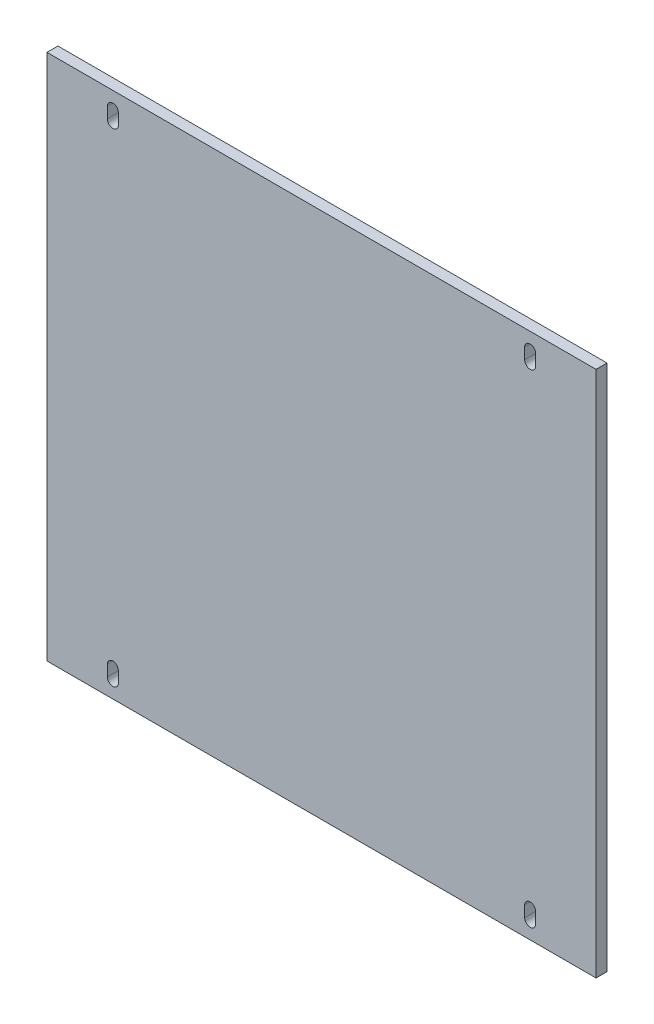
ISO-10303-21;
HEADER;
FILE_DESCRIPTION(('STEP AP214'),'2;1');
FILE_NAME('part.step','',(''),(''),'','','');
FILE_SCHEMA(('AUTOMOTIVE_DESIGN { 1 0 10303 214 1 1 1 1 }'));
ENDSEC;
DATA;
#1=APPLICATION_CONTEXT('core data for automotive mechanical design processes');
#2=APPLICATION_PROTOCOL_DEFINITION('international standard','automotive_design',2000,#1);
#3=PRODUCT_CONTEXT('',#1,'mechanical');
#4=PRODUCT('Part','Part','',(#3));
#5=PRODUCT_RELATED_PRODUCT_CATEGORY('part','',(#4));
#6=PRODUCT_DEFINITION_FORMATION('','',#4);
#7=PRODUCT_DEFINITION_CONTEXT('part definition',#1,'design');
#8=PRODUCT_DEFINITION('design','',#6,#7);
#9=PRODUCT_DEFINITION_SHAPE('','',#8);
#10=(LENGTH_UNIT() NAMED_UNIT(*) SI_UNIT(.MILLI.,.METRE.));
#11=(NAMED_UNIT(*) PLANE_ANGLE_UNIT() SI_UNIT($,.RADIAN.));
#12=(NAMED_UNIT(*) SI_UNIT($,.STERADIAN.) SOLID_ANGLE_UNIT());
#13=UNCERTAINTY_MEASURE_WITH_UNIT(LENGTH_MEASURE(1.E-05),#10,'distance_accuracy_value','');
#14=(GEOMETRIC_REPRESENTATION_CONTEXT(3) GLOBAL_UNCERTAINTY_ASSIGNED_CONTEXT((#13)) GLOBAL_UNIT_ASSIGNED_CONTEXT((#10,
#11,#12)) REPRESENTATION_CONTEXT('',''));
#15=CARTESIAN_POINT('',(0.,0.,0.));
#16=DIRECTION('',(0.,0.,1.));
#17=DIRECTION('',(1.,0.,0.));
#18=AXIS2_PLACEMENT_3D('',#15,#16,#17);
#19=CARTESIAN_POINT('',(217.5,227.5,5.));
#20=DIRECTION('',(1.,0.,0.));
#21=DIRECTION('',(0.,0.,-1.));
#22=AXIS2_PLACEMENT_3D('',#19,#20,#21);
#23=PLANE('',#22);
#24=DIRECTION('',(0.,-1.,0.));
#25=VECTOR('',#24,1.);
#26=CARTESIAN_POINT('',(217.5,227.5,0.));
#27=LINE('',#26,#25);
#28=CARTESIAN_POINT('',(217.5,232.5,0.));
#29=VERTEX_POINT('',#28);
#30=CARTESIAN_POINT('',(217.5,227.5,0.));
#31=VERTEX_POINT('',#30);
#32=EDGE_CURVE('E368',#29,#31,#27,.T.);
#33=ORIENTED_EDGE('',*,*,#32,.F.);
#34=DIRECTION('',(0.,0.,-1.));
#35=VECTOR('',#34,1.);
#36=CARTESIAN_POINT('',(217.5,232.5,5.));
#37=LINE('',#36,#35);
#38=CARTESIAN_POINT('',(217.5,232.5,5.));
#39=VERTEX_POINT('',#38);
#40=EDGE_CURVE('E11',#39,#29,#37,.T.);
#41=ORIENTED_EDGE('',*,*,#40,.F.);
#42=DIRECTION('',(0.,-1.,0.));
#43=VECTOR('',#42,1.);
#44=CARTESIAN_POINT('',(217.5,227.5,5.));
#45=LINE('',#44,#43);
#46=CARTESIAN_POINT('',(217.5,227.5,5.));
#47=VERTEX_POINT('',#46);
#48=EDGE_CURVE('E374',#39,#47,#45,.T.);
#49=ORIENTED_EDGE('',*,*,#48,.T.);
#50=DIRECTION('',(0.,0.,-1.));
#51=VECTOR('',#50,1.);
#52=CARTESIAN_POINT('',(217.5,227.5,5.));
#53=LINE('',#52,#51);
#54=EDGE_CURVE('E383',#47,#31,#53,.T.);
#55=ORIENTED_EDGE('',*,*,#54,.T.);
#56=EDGE_LOOP('',(#33,#41,#49,#55));
#57=FACE_BOUND('',#56,.T.);
#58=ADVANCED_FACE('F39',(#57),#23,.T.);
#59=CARTESIAN_POINT('',(220.,232.5,5.));
#60=DIRECTION('',(0.,0.,-1.));
#61=DIRECTION('',(-1.,0.,0.));
#62=AXIS2_PLACEMENT_3D('',#59,#60,#61);
#63=CYLINDRICAL_SURFACE('',#62,2.5);
#64=CARTESIAN_POINT('',(220.,232.5,0.));
#65=DIRECTION('',(0.,0.,1.));
#66=DIRECTION('',(1.,0.,0.));
#67=AXIS2_PLACEMENT_3D('',#64,#65,#66);
#68=CIRCLE('',#67,2.5);
#69=CARTESIAN_POINT('',(222.5,232.5,0.));
#70=VERTEX_POINT('',#69);
#71=EDGE_CURVE('E365',#70,#29,#68,.T.);
#72=ORIENTED_EDGE('',*,*,#71,.F.);
#73=DIRECTION('',(0.,0.,-1.));
#74=VECTOR('',#73,1.);
#75=CARTESIAN_POINT('',(222.5,232.5,5.));
#76=LINE('',#75,#74);
#77=CARTESIAN_POINT('',(222.5,232.5,5.));
#78=VERTEX_POINT('',#77);
#79=EDGE_CURVE('E47',#78,#70,#76,.T.);
#80=ORIENTED_EDGE('',*,*,#79,.F.);
#81=CARTESIAN_POINT('',(220.,232.5,5.));
#82=DIRECTION('',(0.,0.,1.));
#83=DIRECTION('',(1.,0.,0.));
#84=AXIS2_PLACEMENT_3D('',#81,#82,#83);
#85=CIRCLE('',#84,2.5);
#86=EDGE_CURVE('E61',#78,#39,#85,.T.);
#87=ORIENTED_EDGE('',*,*,#86,.T.);
#88=ORIENTED_EDGE('',*,*,#40,.T.);
#89=EDGE_LOOP('',(#72,#80,#87,#88));
#90=FACE_BOUND('',#89,.T.);
#91=ADVANCED_FACE('F398',(#90),#63,.F.);
#92=CARTESIAN_POINT('',(222.5,227.5,5.));
#93=DIRECTION('',(-1.,0.,0.));
#94=DIRECTION('',(0.,0.,1.));
#95=AXIS2_PLACEMENT_3D('',#92,#93,#94);
#96=PLANE('',#95);
#97=DIRECTION('',(0.,1.,0.));
#98=VECTOR('',#97,1.);
#99=CARTESIAN_POINT('',(222.5,227.5,0.));
#100=LINE('',#99,#98);
#101=CARTESIAN_POINT('',(222.5,227.5,0.));
#102=VERTEX_POINT('',#101);
#103=EDGE_CURVE('E362',#102,#70,#100,.T.);
#104=ORIENTED_EDGE('',*,*,#103,.F.);
#105=DIRECTION('',(0.,0.,-1.));
#106=VECTOR('',#105,1.);
#107=CARTESIAN_POINT('',(222.5,227.5,5.));
#108=LINE('',#107,#106);
#109=CARTESIAN_POINT('',(222.5,227.5,5.));
#110=VERTEX_POINT('',#109);
#111=EDGE_CURVE('E387',#110,#102,#108,.T.);
#112=ORIENTED_EDGE('',*,*,#111,.F.);
#113=DIRECTION('',(0.,1.,0.));
#114=VECTOR('',#113,1.);
#115=CARTESIAN_POINT('',(222.5,227.5,5.));
#116=LINE('',#115,#114);
#117=EDGE_CURVE('E380',#110,#78,#116,.T.);
#118=ORIENTED_EDGE('',*,*,#117,.T.);
#119=ORIENTED_EDGE('',*,*,#79,.T.);
#120=EDGE_LOOP('',(#104,#112,#118,#119));
#121=FACE_BOUND('',#120,.T.);
#122=ADVANCED_FACE('F394',(#121),#96,.T.);
#123=CARTESIAN_POINT('',(220.,227.5,5.));
#124=DIRECTION('',(0.,0.,-1.));
#125=DIRECTION('',(-1.,0.,0.));
#126=AXIS2_PLACEMENT_3D('',#123,#124,#125);
#127=CYLINDRICAL_SURFACE('',#126,2.5);
#128=CARTESIAN_POINT('',(220.,227.5,0.));
#129=DIRECTION('',(0.,0.,1.));
#130=DIRECTION('',(1.,0.,0.));
#131=AXIS2_PLACEMENT_3D('',#128,#129,#130);
#132=CIRCLE('',#131,2.5);
#133=EDGE_CURVE('E359',#31,#102,#132,.T.);
#134=ORIENTED_EDGE('',*,*,#133,.F.);
#135=ORIENTED_EDGE('',*,*,#54,.F.);
#136=CARTESIAN_POINT('',(220.,227.5,5.));
#137=DIRECTION('',(0.,0.,1.));
#138=DIRECTION('',(1.,0.,0.));
#139=AXIS2_PLACEMENT_3D('',#136,#137,#138);
#140=CIRCLE('',#139,2.5);
#141=EDGE_CURVE('E54',#47,#110,#140,.T.);
#142=ORIENTED_EDGE('',*,*,#141,.T.);
#143=ORIENTED_EDGE('',*,*,#111,.T.);
#144=EDGE_LOOP('',(#134,#135,#142,#143));
#145=FACE_BOUND('',#144,.T.);
#146=ADVANCED_FACE('F403',(#145),#127,.F.);
#147=CARTESIAN_POINT('',(217.5,7.50000000000001,5.));
#148=DIRECTION('',(1.,0.,0.));
#149=DIRECTION('',(0.,0.,-1.));
#150=AXIS2_PLACEMENT_3D('',#147,#148,#149);
#151=PLANE('',#150);
#152=DIRECTION('',(0.,-1.,0.));
#153=VECTOR('',#152,1.);
#154=CARTESIAN_POINT('',(217.5,7.50000000000001,0.));
#155=LINE('',#154,#153);
#156=CARTESIAN_POINT('',(217.5,12.5,0.));
#157=VERTEX_POINT('',#156);
#158=CARTESIAN_POINT('',(217.5,7.50000000000001,0.));
#159=VERTEX_POINT('',#158);
#160=EDGE_CURVE('E324',#157,#159,#155,.T.);
#161=ORIENTED_EDGE('',*,*,#160,.F.);
#162=DIRECTION('',(0.,0.,-1.));
#163=VECTOR('',#162,1.);
#164=CARTESIAN_POINT('',(217.5,12.5,5.));
#165=LINE('',#164,#163);
#166=CARTESIAN_POINT('',(217.5,12.5,5.));
#167=VERTEX_POINT('',#166);
#168=EDGE_CURVE('E355',#167,#157,#165,.T.);
#169=ORIENTED_EDGE('',*,*,#168,.F.);
#170=DIRECTION('',(0.,-1.,0.));
#171=VECTOR('',#170,1.);
#172=CARTESIAN_POINT('',(217.5,7.50000000000001,5.));
#173=LINE('',#172,#171);
#174=CARTESIAN_POINT('',(217.5,7.50000000000001,5.));
#175=VERTEX_POINT('',#174);
#176=EDGE_CURVE('E331',#167,#175,#173,.T.);
#177=ORIENTED_EDGE('',*,*,#176,.T.);
#178=DIRECTION('',(0.,0.,-1.));
#179=VECTOR('',#178,1.);
#180=CARTESIAN_POINT('',(217.5,7.50000000000001,5.));
#181=LINE('',#180,#179);
#182=EDGE_CURVE('E343',#175,#159,#181,.T.);
#183=ORIENTED_EDGE('',*,*,#182,.T.);
#184=EDGE_LOOP('',(#161,#169,#177,#183));
#185=FACE_BOUND('',#184,.T.);
#186=ADVANCED_FACE('F405',(#185),#151,.T.);
#187=CARTESIAN_POINT('',(220.,12.5,5.));
#188=DIRECTION('',(0.,0.,-1.));
#189=DIRECTION('',(-1.,0.,0.));
#190=AXIS2_PLACEMENT_3D('',#187,#188,#189);
#191=CYLINDRICAL_SURFACE('',#190,2.5);
#192=CARTESIAN_POINT('',(220.,12.5,0.));
#193=DIRECTION('',(0.,0.,1.));
#194=DIRECTION('',(1.,0.,0.));
#195=AXIS2_PLACEMENT_3D('',#192,#193,#194);
#196=CIRCLE('',#195,2.5);
#197=CARTESIAN_POINT('',(222.5,12.5,0.));
#198=VERTEX_POINT('',#197);
#199=EDGE_CURVE('E321',#198,#157,#196,.T.);
#200=ORIENTED_EDGE('',*,*,#199,.F.);
#201=DIRECTION('',(0.,0.,-1.));
#202=VECTOR('',#201,1.);
#203=CARTESIAN_POINT('',(222.5,12.5,5.));
#204=LINE('',#203,#202);
#205=CARTESIAN_POINT('',(222.5,12.5,5.));
#206=VERTEX_POINT('',#205);
#207=EDGE_CURVE('E351',#206,#198,#204,.T.);
#208=ORIENTED_EDGE('',*,*,#207,.F.);
#209=CARTESIAN_POINT('',(220.,12.5,5.));
#210=DIRECTION('',(0.,0.,1.));
#211=DIRECTION('',(1.,0.,0.));
#212=AXIS2_PLACEMENT_3D('',#209,#210,#211);
#213=CIRCLE('',#212,2.5);
#214=EDGE_CURVE('E335',#206,#167,#213,.T.);
#215=ORIENTED_EDGE('',*,*,#214,.T.);
#216=ORIENTED_EDGE('',*,*,#168,.T.);
#217=EDGE_LOOP('',(#200,#208,#215,#216));
#218=FACE_BOUND('',#217,.T.);
#219=ADVANCED_FACE('F411',(#218),#191,.F.);
#220=CARTESIAN_POINT('',(222.5,7.50000000000001,5.));
#221=DIRECTION('',(-1.,0.,0.));
#222=DIRECTION('',(0.,0.,1.));
#223=AXIS2_PLACEMENT_3D('',#220,#221,#222);
#224=PLANE('',#223);
#225=DIRECTION('',(0.,1.,0.));
#226=VECTOR('',#225,1.);
#227=CARTESIAN_POINT('',(222.5,7.50000000000001,0.));
#228=LINE('',#227,#226);
#229=CARTESIAN_POINT('',(222.5,7.50000000000001,0.));
#230=VERTEX_POINT('',#229);
#231=EDGE_CURVE('E318',#230,#198,#228,.T.);
#232=ORIENTED_EDGE('',*,*,#231,.F.);
#233=DIRECTION('',(0.,0.,-1.));
#234=VECTOR('',#233,1.);
#235=CARTESIAN_POINT('',(222.5,7.50000000000001,5.));
#236=LINE('',#235,#234);
#237=CARTESIAN_POINT('',(222.5,7.50000000000001,5.));
#238=VERTEX_POINT('',#237);
#239=EDGE_CURVE('E347',#238,#230,#236,.T.);
#240=ORIENTED_EDGE('',*,*,#239,.F.);
#241=DIRECTION('',(0.,1.,0.));
#242=VECTOR('',#241,1.);
#243=CARTESIAN_POINT('',(222.5,7.50000000000001,5.));
#244=LINE('',#243,#242);
#245=EDGE_CURVE('E339',#238,#206,#244,.T.);
#246=ORIENTED_EDGE('',*,*,#245,.T.);
#247=ORIENTED_EDGE('',*,*,#207,.T.);
#248=EDGE_LOOP('',(#232,#240,#246,#247));
#249=FACE_BOUND('',#248,.T.);
#250=ADVANCED_FACE('F444',(#249),#224,.T.);
#251=CARTESIAN_POINT('',(220.,7.50000000000001,5.));
#252=DIRECTION('',(0.,0.,-1.));
#253=DIRECTION('',(-1.,0.,0.));
#254=AXIS2_PLACEMENT_3D('',#251,#252,#253);
#255=CYLINDRICAL_SURFACE('',#254,2.5);
#256=CARTESIAN_POINT('',(220.,7.50000000000001,0.));
#257=DIRECTION('',(0.,0.,1.));
#258=DIRECTION('',(1.,0.,0.));
#259=AXIS2_PLACEMENT_3D('',#256,#257,#258);
#260=CIRCLE('',#259,2.5);
#261=EDGE_CURVE('E315',#159,#230,#260,.T.);
#262=ORIENTED_EDGE('',*,*,#261,.F.);
#263=ORIENTED_EDGE('',*,*,#182,.F.);
#264=CARTESIAN_POINT('',(220.,7.50000000000001,5.));
#265=DIRECTION('',(0.,0.,1.));
#266=DIRECTION('',(1.,0.,0.));
#267=AXIS2_PLACEMENT_3D('',#264,#265,#266);
#268=CIRCLE('',#267,2.5);
#269=EDGE_CURVE('E328',#175,#238,#268,.T.);
#270=ORIENTED_EDGE('',*,*,#269,.T.);
#271=ORIENTED_EDGE('',*,*,#239,.T.);
#272=EDGE_LOOP('',(#262,#263,#270,#271));
#273=FACE_BOUND('',#272,.T.);
#274=ADVANCED_FACE('F454',(#273),#255,.F.);
#275=CARTESIAN_POINT('',(0.,0.,5.));
#276=DIRECTION('',(0.,0.,-1.));
#277=DIRECTION('',(-1.,0.,0.));
#278=AXIS2_PLACEMENT_3D('',#275,#276,#277);
#279=PLANE('',#278);
#280=CARTESIAN_POINT('',(30.,7.5,5.));
#281=DIRECTION('',(0.,0.,1.));
#282=DIRECTION('',(1.,0.,0.));
#283=AXIS2_PLACEMENT_3D('',#280,#281,#282);
#284=CIRCLE('',#283,2.5);
#285=CARTESIAN_POINT('',(27.5,7.5,5.));
#286=VERTEX_POINT('',#285);
#287=CARTESIAN_POINT('',(32.5,7.5,5.));
#288=VERTEX_POINT('',#287);
#289=EDGE_CURVE('E231',#286,#288,#284,.T.);
#290=ORIENTED_EDGE('',*,*,#289,.F.);
#291=DIRECTION('',(0.,-1.,0.));
#292=VECTOR('',#291,1.);
#293=CARTESIAN_POINT('',(27.5,7.5,5.));
#294=LINE('',#293,#292);
#295=CARTESIAN_POINT('',(27.5,12.5,5.));
#296=VERTEX_POINT('',#295);
#297=EDGE_CURVE('E242',#296,#286,#294,.T.);
#298=ORIENTED_EDGE('',*,*,#297,.F.);
#299=CARTESIAN_POINT('',(30.,12.5,5.));
#300=DIRECTION('',(0.,0.,1.));
#301=DIRECTION('',(1.,0.,0.));
#302=AXIS2_PLACEMENT_3D('',#299,#300,#301);
#303=CIRCLE('',#302,2.5);
#304=CARTESIAN_POINT('',(32.5,12.5,5.));
#305=VERTEX_POINT('',#304);
#306=EDGE_CURVE('E238',#305,#296,#303,.T.);
#307=ORIENTED_EDGE('',*,*,#306,.F.);
#308=DIRECTION('',(0.,1.,0.));
#309=VECTOR('',#308,1.);
#310=CARTESIAN_POINT('',(32.5,7.5,5.));
#311=LINE('',#310,#309);
#312=EDGE_CURVE('E234',#288,#305,#311,.T.);
#313=ORIENTED_EDGE('',*,*,#312,.F.);
#314=EDGE_LOOP('',(#290,#298,#307,#313));
#315=FACE_BOUND('',#314,.T.);
#316=DIRECTION('',(0.,-1.,0.));
#317=VECTOR('',#316,1.);
#318=CARTESIAN_POINT('',(0.,0.,5.));
#319=LINE('',#318,#317);
#320=CARTESIAN_POINT('',(0.,240.,5.));
#321=VERTEX_POINT('',#320);
#322=CARTESIAN_POINT('',(0.,0.,5.));
#323=VERTEX_POINT('',#322);
#324=EDGE_CURVE('E274',#321,#323,#319,.T.);
#325=ORIENTED_EDGE('',*,*,#324,.T.);
#326=DIRECTION('',(1.,0.,0.));
#327=VECTOR('',#326,1.);
#328=CARTESIAN_POINT('',(0.,0.,5.));
#329=LINE('',#328,#327);
#330=CARTESIAN_POINT('',(250.,0.,5.));
#331=VERTEX_POINT('',#330);
#332=EDGE_CURVE('E278',#323,#331,#329,.T.);
#333=ORIENTED_EDGE('',*,*,#332,.T.);
#334=DIRECTION('',(0.,1.,0.));
#335=VECTOR('',#334,1.);
#336=CARTESIAN_POINT('',(250.,0.,5.));
#337=LINE('',#336,#335);
#338=CARTESIAN_POINT('',(250.,240.,5.));
#339=VERTEX_POINT('',#338);
#340=EDGE_CURVE('E282',#331,#339,#337,.T.);
#341=ORIENTED_EDGE('',*,*,#340,.T.);
#342=DIRECTION('',(-1.,0.,0.));
#343=VECTOR('',#342,1.);
#344=CARTESIAN_POINT('',(0.,240.,5.));
#345=LINE('',#344,#343);
#346=EDGE_CURVE('E285',#339,#321,#345,.T.);
#347=ORIENTED_EDGE('',*,*,#346,.T.);
#348=EDGE_LOOP('',(#325,#333,#341,#347));
#349=FACE_BOUND('',#348,.T.);
#350=CARTESIAN_POINT('',(30.,227.5,5.));
#351=DIRECTION('',(0.,0.,1.));
#352=DIRECTION('',(1.,0.,0.));
#353=AXIS2_PLACEMENT_3D('',#350,#351,#352);
#354=CIRCLE('',#353,2.5);
#355=CARTESIAN_POINT('',(27.5,227.5,5.));
#356=VERTEX_POINT('',#355);
#357=CARTESIAN_POINT('',(32.5,227.5,5.));
#358=VERTEX_POINT('',#357);
#359=EDGE_CURVE('E226',#356,#358,#354,.T.);
#360=ORIENTED_EDGE('',*,*,#359,.F.);
#361=DIRECTION('',(0.,-1.,0.));
#362=VECTOR('',#361,1.);
#363=CARTESIAN_POINT('',(27.5,227.5,5.));
#364=LINE('',#363,#362);
#365=CARTESIAN_POINT('',(27.5,232.5,5.));
#366=VERTEX_POINT('',#365);
#367=EDGE_CURVE('E189',#366,#356,#364,.T.);
#368=ORIENTED_EDGE('',*,*,#367,.F.);
#369=CARTESIAN_POINT('',(30.,232.5,5.));
#370=DIRECTION('',(0.,0.,1.));
#371=DIRECTION('',(1.,0.,0.));
#372=AXIS2_PLACEMENT_3D('',#369,#370,#371);
#373=CIRCLE('',#372,2.5);
#374=CARTESIAN_POINT('',(32.5,232.5,5.));
#375=VERTEX_POINT('',#374);
#376=EDGE_CURVE('E196',#375,#366,#373,.T.);
#377=ORIENTED_EDGE('',*,*,#376,.F.);
#378=DIRECTION('',(0.,1.,0.));
#379=VECTOR('',#378,1.);
#380=CARTESIAN_POINT('',(32.5,227.5,5.));
#381=LINE('',#380,#379);
#382=EDGE_CURVE('E219',#358,#375,#381,.T.);
#383=ORIENTED_EDGE('',*,*,#382,.F.);
#384=EDGE_LOOP('',(#360,#368,#377,#383));
#385=FACE_BOUND('',#384,.T.);
#386=ORIENTED_EDGE('',*,*,#269,.F.);
#387=ORIENTED_EDGE('',*,*,#176,.F.);
#388=ORIENTED_EDGE('',*,*,#214,.F.);
#389=ORIENTED_EDGE('',*,*,#245,.F.);
#390=EDGE_LOOP('',(#386,#387,#388,#389));
#391=FACE_BOUND('',#390,.T.);
#392=ORIENTED_EDGE('',*,*,#141,.F.);
#393=ORIENTED_EDGE('',*,*,#48,.F.);
#394=ORIENTED_EDGE('',*,*,#86,.F.);
#395=ORIENTED_EDGE('',*,*,#117,.F.);
#396=EDGE_LOOP('',(#392,#393,#394,#395));
#397=FACE_BOUND('',#396,.T.);
#398=ADVANCED_FACE('F464',(#315,#349,#385,#391,#397),#279,.F.);
#399=CARTESIAN_POINT('',(0.,0.,0.));
#400=DIRECTION('',(0.,0.,-1.));
#401=DIRECTION('',(-1.,0.,0.));
#402=AXIS2_PLACEMENT_3D('',#399,#400,#401);
#403=PLANE('',#402);
#404=DIRECTION('',(0.,-1.,0.));
#405=VECTOR('',#404,1.);
#406=CARTESIAN_POINT('',(0.,0.,0.));
#407=LINE('',#406,#405);
#408=CARTESIAN_POINT('',(0.,240.,0.));
#409=VERTEX_POINT('',#408);
#410=CARTESIAN_POINT('',(0.,0.,0.));
#411=VERTEX_POINT('',#410);
#412=EDGE_CURVE('E273',#409,#411,#407,.T.);
#413=ORIENTED_EDGE('',*,*,#412,.F.);
#414=DIRECTION('',(-1.,0.,0.));
#415=VECTOR('',#414,1.);
#416=CARTESIAN_POINT('',(0.,240.,0.));
#417=LINE('',#416,#415);
#418=CARTESIAN_POINT('',(250.,240.,0.));
#419=VERTEX_POINT('',#418);
#420=EDGE_CURVE('E279',#419,#409,#417,.T.);
#421=ORIENTED_EDGE('',*,*,#420,.F.);
#422=DIRECTION('',(0.,1.,0.));
#423=VECTOR('',#422,1.);
#424=CARTESIAN_POINT('',(250.,0.,0.));
#425=LINE('',#424,#423);
#426=CARTESIAN_POINT('',(250.,0.,0.));
#427=VERTEX_POINT('',#426);
#428=EDGE_CURVE('E295',#427,#419,#425,.T.);
#429=ORIENTED_EDGE('',*,*,#428,.F.);
#430=DIRECTION('',(1.,0.,0.));
#431=VECTOR('',#430,1.);
#432=CARTESIAN_POINT('',(0.,0.,0.));
#433=LINE('',#432,#431);
#434=EDGE_CURVE('E292',#411,#427,#433,.T.);
#435=ORIENTED_EDGE('',*,*,#434,.F.);
#436=EDGE_LOOP('',(#413,#421,#429,#435));
#437=FACE_BOUND('',#436,.T.);
#438=DIRECTION('',(0.,-1.,0.));
#439=VECTOR('',#438,1.);
#440=CARTESIAN_POINT('',(27.5,7.5,0.));
#441=LINE('',#440,#439);
#442=CARTESIAN_POINT('',(27.5,12.5,0.));
#443=VERTEX_POINT('',#442);
#444=CARTESIAN_POINT('',(27.5,7.5,0.));
#445=VERTEX_POINT('',#444);
#446=EDGE_CURVE('E235',#443,#445,#441,.T.);
#447=ORIENTED_EDGE('',*,*,#446,.T.);
#448=CARTESIAN_POINT('',(30.,7.5,0.));
#449=DIRECTION('',(0.,0.,1.));
#450=DIRECTION('',(1.,0.,0.));
#451=AXIS2_PLACEMENT_3D('',#448,#449,#450);
#452=CIRCLE('',#451,2.5);
#453=CARTESIAN_POINT('',(32.5,7.5,0.));
#454=VERTEX_POINT('',#453);
#455=EDGE_CURVE('E230',#445,#454,#452,.T.);
#456=ORIENTED_EDGE('',*,*,#455,.T.);
#457=DIRECTION('',(0.,1.,0.));
#458=VECTOR('',#457,1.);
#459=CARTESIAN_POINT('',(32.5,7.5,0.));
#460=LINE('',#459,#458);
#461=CARTESIAN_POINT('',(32.5,12.5,0.));
#462=VERTEX_POINT('',#461);
#463=EDGE_CURVE('E249',#454,#462,#460,.T.);
#464=ORIENTED_EDGE('',*,*,#463,.T.);
#465=CARTESIAN_POINT('',(30.,12.5,0.));
#466=DIRECTION('',(0.,0.,1.));
#467=DIRECTION('',(1.,0.,0.));
#468=AXIS2_PLACEMENT_3D('',#465,#466,#467);
#469=CIRCLE('',#468,2.5);
#470=EDGE_CURVE('E253',#462,#443,#469,.T.);
#471=ORIENTED_EDGE('',*,*,#470,.T.);
#472=EDGE_LOOP('',(#447,#456,#464,#471));
#473=FACE_BOUND('',#472,.T.);
#474=DIRECTION('',(0.,-1.,0.));
#475=VECTOR('',#474,1.);
#476=CARTESIAN_POINT('',(27.5,227.5,0.));
#477=LINE('',#476,#475);
#478=CARTESIAN_POINT('',(27.5,232.5,0.));
#479=VERTEX_POINT('',#478);
#480=CARTESIAN_POINT('',(27.5,227.5,0.));
#481=VERTEX_POINT('',#480);
#482=EDGE_CURVE('E178',#479,#481,#477,.T.);
#483=ORIENTED_EDGE('',*,*,#482,.T.);
#484=CARTESIAN_POINT('',(30.,227.5,0.));
#485=DIRECTION('',(0.,0.,1.));
#486=DIRECTION('',(1.,0.,0.));
#487=AXIS2_PLACEMENT_3D('',#484,#485,#486);
#488=CIRCLE('',#487,2.5);
#489=CARTESIAN_POINT('',(32.5,227.5,0.));
#490=VERTEX_POINT('',#489);
#491=EDGE_CURVE('E223',#481,#490,#488,.T.);
#492=ORIENTED_EDGE('',*,*,#491,.T.);
#493=DIRECTION('',(0.,1.,0.));
#494=VECTOR('',#493,1.);
#495=CARTESIAN_POINT('',(32.5,227.5,0.));
#496=LINE('',#495,#494);
#497=CARTESIAN_POINT('',(32.5,232.5,0.));
#498=VERTEX_POINT('',#497);
#499=EDGE_CURVE('E202',#490,#498,#496,.T.);
#500=ORIENTED_EDGE('',*,*,#499,.T.);
#501=CARTESIAN_POINT('',(30.,232.5,0.));
#502=DIRECTION('',(0.,0.,1.));
#503=DIRECTION('',(1.,0.,0.));
#504=AXIS2_PLACEMENT_3D('',#501,#502,#503);
#505=CIRCLE('',#504,2.5);
#506=EDGE_CURVE('E193',#498,#479,#505,.T.);
#507=ORIENTED_EDGE('',*,*,#506,.T.);
#508=EDGE_LOOP('',(#483,#492,#500,#507));
#509=FACE_BOUND('',#508,.T.);
#510=ORIENTED_EDGE('',*,*,#261,.T.);
#511=ORIENTED_EDGE('',*,*,#231,.T.);
#512=ORIENTED_EDGE('',*,*,#199,.T.);
#513=ORIENTED_EDGE('',*,*,#160,.T.);
#514=EDGE_LOOP('',(#510,#511,#512,#513));
#515=FACE_BOUND('',#514,.T.);
#516=ORIENTED_EDGE('',*,*,#133,.T.);
#517=ORIENTED_EDGE('',*,*,#103,.T.);
#518=ORIENTED_EDGE('',*,*,#71,.T.);
#519=ORIENTED_EDGE('',*,*,#32,.T.);
#520=EDGE_LOOP('',(#516,#517,#518,#519));
#521=FACE_BOUND('',#520,.T.);
#522=ADVANCED_FACE('F200',(#437,#473,#509,#515,#521),#403,.T.);
#523=CARTESIAN_POINT('',(0.,0.,5.));
#524=DIRECTION('',(1.,0.,0.));
#525=DIRECTION('',(0.,0.,-1.));
#526=AXIS2_PLACEMENT_3D('',#523,#524,#525);
#527=PLANE('',#526);
#528=ORIENTED_EDGE('',*,*,#412,.T.);
#529=DIRECTION('',(0.,0.,-1.));
#530=VECTOR('',#529,1.);
#531=CARTESIAN_POINT('',(0.,0.,5.));
#532=LINE('',#531,#530);
#533=EDGE_CURVE('E311',#323,#411,#532,.T.);
#534=ORIENTED_EDGE('',*,*,#533,.F.);
#535=ORIENTED_EDGE('',*,*,#324,.F.);
#536=DIRECTION('',(0.,0.,-1.));
#537=VECTOR('',#536,1.);
#538=CARTESIAN_POINT('',(0.,240.,5.));
#539=LINE('',#538,#537);
#540=EDGE_CURVE('E288',#321,#409,#539,.T.);
#541=ORIENTED_EDGE('',*,*,#540,.T.);
#542=EDGE_LOOP('',(#528,#534,#535,#541));
#543=FACE_BOUND('',#542,.T.);
#544=ADVANCED_FACE('F485',(#543),#527,.F.);
#545=CARTESIAN_POINT('',(0.,0.,5.));
#546=DIRECTION('',(0.,1.,0.));
#547=DIRECTION('',(0.,0.,1.));
#548=AXIS2_PLACEMENT_3D('',#545,#546,#547);
#549=PLANE('',#548);
#550=ORIENTED_EDGE('',*,*,#434,.T.);
#551=DIRECTION('',(0.,0.,-1.));
#552=VECTOR('',#551,1.);
#553=CARTESIAN_POINT('',(250.,0.,5.));
#554=LINE('',#553,#552);
#555=EDGE_CURVE('E307',#331,#427,#554,.T.);
#556=ORIENTED_EDGE('',*,*,#555,.F.);
#557=ORIENTED_EDGE('',*,*,#332,.F.);
#558=ORIENTED_EDGE('',*,*,#533,.T.);
#559=EDGE_LOOP('',(#550,#556,#557,#558));
#560=FACE_BOUND('',#559,.T.);
#561=ADVANCED_FACE('F551',(#560),#549,.F.);
#562=CARTESIAN_POINT('',(250.,0.,5.));
#563=DIRECTION('',(-1.,0.,0.));
#564=DIRECTION('',(0.,0.,1.));
#565=AXIS2_PLACEMENT_3D('',#562,#563,#564);
#566=PLANE('',#565);
#567=ORIENTED_EDGE('',*,*,#428,.T.);
#568=DIRECTION('',(0.,0.,-1.));
#569=VECTOR('',#568,1.);
#570=CARTESIAN_POINT('',(250.,240.,5.));
#571=LINE('',#570,#569);
#572=EDGE_CURVE('E303',#339,#419,#571,.T.);
#573=ORIENTED_EDGE('',*,*,#572,.F.);
#574=ORIENTED_EDGE('',*,*,#340,.F.);
#575=ORIENTED_EDGE('',*,*,#555,.T.);
#576=EDGE_LOOP('',(#567,#573,#574,#575));
#577=FACE_BOUND('',#576,.T.);
#578=ADVANCED_FACE('F547',(#577),#566,.F.);
#579=CARTESIAN_POINT('',(0.,240.,5.));
#580=DIRECTION('',(0.,-1.,0.));
#581=DIRECTION('',(0.,0.,-1.));
#582=AXIS2_PLACEMENT_3D('',#579,#580,#581);
#583=PLANE('',#582);
#584=ORIENTED_EDGE('',*,*,#420,.T.);
#585=ORIENTED_EDGE('',*,*,#540,.F.);
#586=ORIENTED_EDGE('',*,*,#346,.F.);
#587=ORIENTED_EDGE('',*,*,#572,.T.);
#588=EDGE_LOOP('',(#584,#585,#586,#587));
#589=FACE_BOUND('',#588,.T.);
#590=ADVANCED_FACE('F542',(#589),#583,.F.);
#591=CARTESIAN_POINT('',(30.,7.5,5.));
#592=DIRECTION('',(0.,0.,-1.));
#593=DIRECTION('',(-1.,0.,0.));
#594=AXIS2_PLACEMENT_3D('',#591,#592,#593);
#595=CYLINDRICAL_SURFACE('',#594,2.5);
#596=ORIENTED_EDGE('',*,*,#455,.F.);
#597=DIRECTION('',(0.,0.,-1.));
#598=VECTOR('',#597,1.);
#599=CARTESIAN_POINT('',(27.5,7.5,5.));
#600=LINE('',#599,#598);
#601=EDGE_CURVE('E245',#286,#445,#600,.T.);
#602=ORIENTED_EDGE('',*,*,#601,.F.);
#603=ORIENTED_EDGE('',*,*,#289,.T.);
#604=DIRECTION('',(0.,0.,-1.));
#605=VECTOR('',#604,1.);
#606=CARTESIAN_POINT('',(32.5,7.5,5.));
#607=LINE('',#606,#605);
#608=EDGE_CURVE('E269',#288,#454,#607,.T.);
#609=ORIENTED_EDGE('',*,*,#608,.T.);
#610=EDGE_LOOP('',(#596,#602,#603,#609));
#611=FACE_BOUND('',#610,.T.);
#612=ADVANCED_FACE('F539',(#611),#595,.F.);
#613=CARTESIAN_POINT('',(32.5,7.5,5.));
#614=DIRECTION('',(-1.,0.,0.));
#615=DIRECTION('',(0.,0.,1.));
#616=AXIS2_PLACEMENT_3D('',#613,#614,#615);
#617=PLANE('',#616);
#618=ORIENTED_EDGE('',*,*,#463,.F.);
#619=ORIENTED_EDGE('',*,*,#608,.F.);
#620=ORIENTED_EDGE('',*,*,#312,.T.);
#621=DIRECTION('',(0.,0.,-1.));
#622=VECTOR('',#621,1.);
#623=CARTESIAN_POINT('',(32.5,12.5,5.));
#624=LINE('',#623,#622);
#625=EDGE_CURVE('E266',#305,#462,#624,.T.);
#626=ORIENTED_EDGE('',*,*,#625,.T.);
#627=EDGE_LOOP('',(#618,#619,#620,#626));
#628=FACE_BOUND('',#627,.T.);
#629=ADVANCED_FACE('F535',(#628),#617,.T.);
#630=CARTESIAN_POINT('',(30.,12.5,5.));
#631=DIRECTION('',(0.,0.,-1.));
#632=DIRECTION('',(-1.,0.,0.));
#633=AXIS2_PLACEMENT_3D('',#630,#631,#632);
#634=CYLINDRICAL_SURFACE('',#633,2.5);
#635=ORIENTED_EDGE('',*,*,#470,.F.);
#636=ORIENTED_EDGE('',*,*,#625,.F.);
#637=ORIENTED_EDGE('',*,*,#306,.T.);
#638=DIRECTION('',(0.,0.,-1.));
#639=VECTOR('',#638,1.);
#640=CARTESIAN_POINT('',(27.5,12.5,5.));
#641=LINE('',#640,#639);
#642=EDGE_CURVE('E263',#296,#443,#641,.T.);
#643=ORIENTED_EDGE('',*,*,#642,.T.);
#644=EDGE_LOOP('',(#635,#636,#637,#643));
#645=FACE_BOUND('',#644,.T.);
#646=ADVANCED_FACE('F531',(#645),#634,.F.);
#647=CARTESIAN_POINT('',(27.5,7.5,5.));
#648=DIRECTION('',(1.,0.,0.));
#649=DIRECTION('',(0.,0.,-1.));
#650=AXIS2_PLACEMENT_3D('',#647,#648,#649);
#651=PLANE('',#650);
#652=ORIENTED_EDGE('',*,*,#446,.F.);
#653=ORIENTED_EDGE('',*,*,#642,.F.);
#654=ORIENTED_EDGE('',*,*,#297,.T.);
#655=ORIENTED_EDGE('',*,*,#601,.T.);
#656=EDGE_LOOP('',(#652,#653,#654,#655));
#657=FACE_BOUND('',#656,.T.);
#658=ADVANCED_FACE('F498',(#657),#651,.T.);
#659=CARTESIAN_POINT('',(30.,227.5,5.));
#660=DIRECTION('',(0.,0.,-1.));
#661=DIRECTION('',(-1.,0.,0.));
#662=AXIS2_PLACEMENT_3D('',#659,#660,#661);
#663=CYLINDRICAL_SURFACE('',#662,2.5);
#664=ORIENTED_EDGE('',*,*,#491,.F.);
#665=DIRECTION('',(0.,0.,-1.));
#666=VECTOR('',#665,1.);
#667=CARTESIAN_POINT('',(27.5,227.5,5.));
#668=LINE('',#667,#666);
#669=EDGE_CURVE('E184',#356,#481,#668,.T.);
#670=ORIENTED_EDGE('',*,*,#669,.F.);
#671=ORIENTED_EDGE('',*,*,#359,.T.);
#672=DIRECTION('',(0.,0.,-1.));
#673=VECTOR('',#672,1.);
#674=CARTESIAN_POINT('',(32.5,227.5,5.));
#675=LINE('',#674,#673);
#676=EDGE_CURVE('E215',#358,#490,#675,.T.);
#677=ORIENTED_EDGE('',*,*,#676,.T.);
#678=EDGE_LOOP('',(#664,#670,#671,#677));
#679=FACE_BOUND('',#678,.T.);
#680=ADVANCED_FACE('F493',(#679),#663,.F.);
#681=CARTESIAN_POINT('',(32.5,227.5,5.));
#682=DIRECTION('',(-1.,0.,0.));
#683=DIRECTION('',(0.,0.,1.));
#684=AXIS2_PLACEMENT_3D('',#681,#682,#683);
#685=PLANE('',#684);
#686=ORIENTED_EDGE('',*,*,#499,.F.);
#687=ORIENTED_EDGE('',*,*,#676,.F.);
#688=ORIENTED_EDGE('',*,*,#382,.T.);
#689=DIRECTION('',(0.,0.,-1.));
#690=VECTOR('',#689,1.);
#691=CARTESIAN_POINT('',(32.5,232.5,5.));
#692=LINE('',#691,#690);
#693=EDGE_CURVE('E204',#375,#498,#692,.T.);
#694=ORIENTED_EDGE('',*,*,#693,.T.);
#695=EDGE_LOOP('',(#686,#687,#688,#694));
#696=FACE_BOUND('',#695,.T.);
#697=ADVANCED_FACE('F497',(#696),#685,.T.);
#698=CARTESIAN_POINT('',(30.,232.5,5.));
#699=DIRECTION('',(0.,0.,-1.));
#700=DIRECTION('',(-1.,0.,0.));
#701=AXIS2_PLACEMENT_3D('',#698,#699,#700);
#702=CYLINDRICAL_SURFACE('',#701,2.5);
#703=ORIENTED_EDGE('',*,*,#506,.F.);
#704=ORIENTED_EDGE('',*,*,#693,.F.);
#705=ORIENTED_EDGE('',*,*,#376,.T.);
#706=DIRECTION('',(0.,0.,-1.));
#707=VECTOR('',#706,1.);
#708=CARTESIAN_POINT('',(27.5,232.5,5.));
#709=LINE('',#708,#707);
#710=EDGE_CURVE('E181',#366,#479,#709,.T.);
#711=ORIENTED_EDGE('',*,*,#710,.T.);
#712=EDGE_LOOP('',(#703,#704,#705,#711));
#713=FACE_BOUND('',#712,.T.);
#714=ADVANCED_FACE('F192',(#713),#702,.F.);
#715=CARTESIAN_POINT('',(27.5,227.5,5.));
#716=DIRECTION('',(1.,0.,0.));
#717=DIRECTION('',(0.,0.,-1.));
#718=AXIS2_PLACEMENT_3D('',#715,#716,#717);
#719=PLANE('',#718);
#720=ORIENTED_EDGE('',*,*,#482,.F.);
#721=ORIENTED_EDGE('',*,*,#710,.F.);
#722=ORIENTED_EDGE('',*,*,#367,.T.);
#723=ORIENTED_EDGE('',*,*,#669,.T.);
#724=EDGE_LOOP('',(#720,#721,#722,#723));
#725=FACE_BOUND('',#724,.T.);
#726=ADVANCED_FACE('F180',(#725),#719,.T.);
#727=CLOSED_SHELL('',(#58,#91,#122,#146,#186,#219,#250,#274,#398,#522,#544,#561,#578,#590,#612,
#629,#646,#658,#680,#697,#714,#726));
#728=MANIFOLD_SOLID_BREP('B2',#727);
#729=ADVANCED_BREP_SHAPE_REPRESENTATION('',(#18,#728),#14);
#730=SHAPE_DEFINITION_REPRESENTATION(#9,#729);
ENDSEC;
END-ISO-10303-21;
